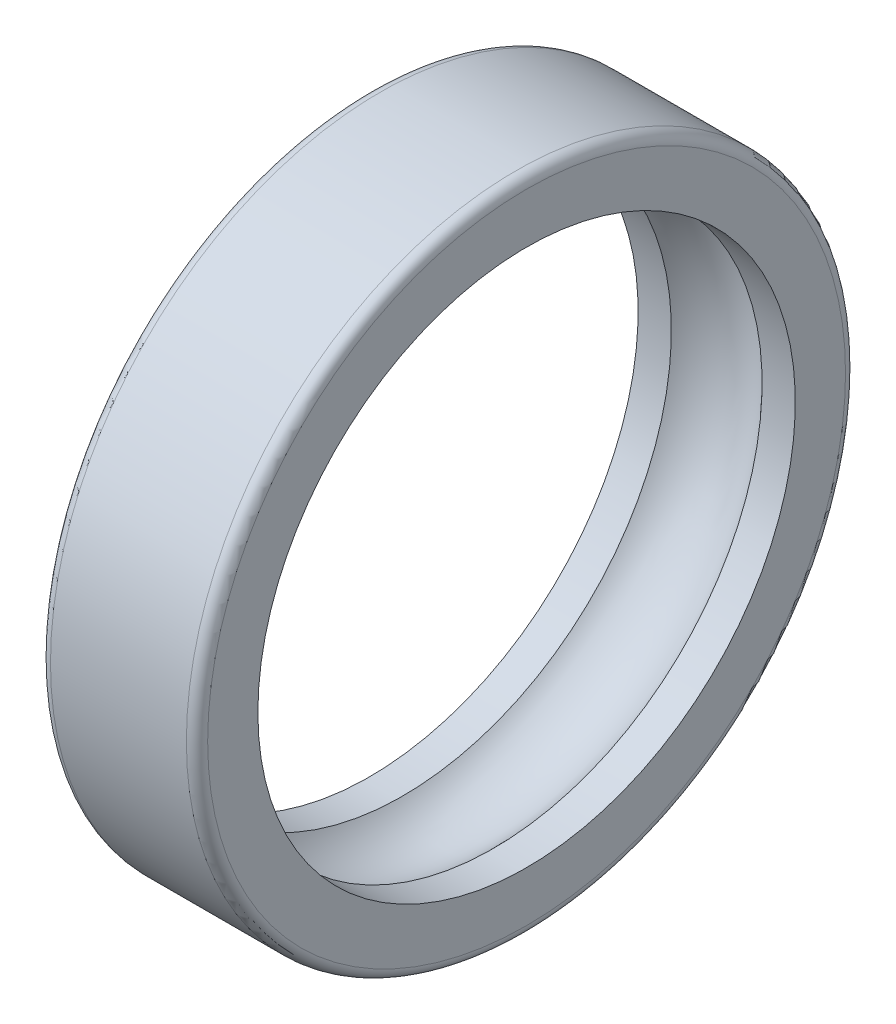
ISO-10303-21;
HEADER;
FILE_DESCRIPTION(('STEP AP214'),'2;1');
FILE_NAME('part.step','',(''),(''),'','','');
FILE_SCHEMA(('AUTOMOTIVE_DESIGN { 1 0 10303 214 1 1 1 1 }'));
ENDSEC;
DATA;
#1=APPLICATION_CONTEXT('core data for automotive mechanical design processes');
#2=APPLICATION_PROTOCOL_DEFINITION('international standard','automotive_design',2000,#1);
#3=PRODUCT_CONTEXT('',#1,'mechanical');
#4=PRODUCT('Part','Part','',(#3));
#5=PRODUCT_RELATED_PRODUCT_CATEGORY('part','',(#4));
#6=PRODUCT_DEFINITION_FORMATION('','',#4);
#7=PRODUCT_DEFINITION_CONTEXT('part definition',#1,'design');
#8=PRODUCT_DEFINITION('design','',#6,#7);
#9=PRODUCT_DEFINITION_SHAPE('','',#8);
#10=(LENGTH_UNIT() NAMED_UNIT(*) SI_UNIT(.MILLI.,.METRE.));
#11=(NAMED_UNIT(*) PLANE_ANGLE_UNIT() SI_UNIT($,.RADIAN.));
#12=(NAMED_UNIT(*) SI_UNIT($,.STERADIAN.) SOLID_ANGLE_UNIT());
#13=UNCERTAINTY_MEASURE_WITH_UNIT(LENGTH_MEASURE(1.E-05),#10,'distance_accuracy_value','');
#14=(GEOMETRIC_REPRESENTATION_CONTEXT(3) GLOBAL_UNCERTAINTY_ASSIGNED_CONTEXT((#13)) GLOBAL_UNIT_ASSIGNED_CONTEXT((#10,
#11,#12)) REPRESENTATION_CONTEXT('',''));
#15=CARTESIAN_POINT('',(0.,0.,0.));
#16=DIRECTION('',(0.,0.,1.));
#17=DIRECTION('',(1.,0.,0.));
#18=AXIS2_PLACEMENT_3D('',#15,#16,#17);
#19=CARTESIAN_POINT('',(15.5,53.,0.));
#20=DIRECTION('',(-1.,0.,0.));
#21=DIRECTION('',(0.,0.,1.));
#22=AXIS2_PLACEMENT_3D('',#19,#20,#21);
#23=PLANE('',#22);
#24=CARTESIAN_POINT('',(15.5,0.,0.));
#25=DIRECTION('',(-1.,0.,0.));
#26=DIRECTION('',(0.,0.,1.));
#27=AXIS2_PLACEMENT_3D('',#24,#25,#26);
#28=CIRCLE('',#27,62.9);
#29=CARTESIAN_POINT('',(15.5,0.,62.9));
#30=VERTEX_POINT('',#29);
#31=EDGE_CURVE('E49',#30,#30,#28,.F.);
#32=ORIENTED_EDGE('',*,*,#31,.T.);
#33=EDGE_LOOP('',(#32));
#34=FACE_BOUND('',#33,.T.);
#35=CARTESIAN_POINT('',(15.5,0.,0.));
#36=DIRECTION('',(-1.,0.,0.));
#37=DIRECTION('',(0.,0.,1.));
#38=AXIS2_PLACEMENT_3D('',#35,#36,#37);
#39=CIRCLE('',#38,53.);
#40=CARTESIAN_POINT('',(15.5,0.,53.));
#41=VERTEX_POINT('',#40);
#42=EDGE_CURVE('E65',#41,#41,#39,.T.);
#43=ORIENTED_EDGE('',*,*,#42,.T.);
#44=EDGE_LOOP('',(#43));
#45=FACE_BOUND('',#44,.T.);
#46=ADVANCED_FACE('F41',(#34,#45),#23,.F.);
#47=CARTESIAN_POINT('',(-47.7916666666667,0.,0.));
#48=DIRECTION('',(-1.,0.,0.));
#49=DIRECTION('',(0.,0.,1.));
#50=AXIS2_PLACEMENT_3D('',#47,#48,#49);
#51=CYLINDRICAL_SURFACE('',#50,53.);
#52=ORIENTED_EDGE('',*,*,#42,.F.);
#53=EDGE_LOOP('',(#52));
#54=FACE_BOUND('',#53,.T.);
#55=CARTESIAN_POINT('',(8.94427190999916,0.,0.));
#56=DIRECTION('',(-1.,0.,0.));
#57=DIRECTION('',(0.,0.,1.));
#58=AXIS2_PLACEMENT_3D('',#55,#56,#57);
#59=CIRCLE('',#58,53.);
#60=CARTESIAN_POINT('',(8.94427190999916,0.,53.));
#61=VERTEX_POINT('',#60);
#62=EDGE_CURVE('E69',#61,#61,#59,.T.);
#63=ORIENTED_EDGE('',*,*,#62,.T.);
#64=EDGE_LOOP('',(#63));
#65=FACE_BOUND('',#64,.T.);
#66=ADVANCED_FACE('F99',(#54,#65),#51,.F.);
#67=CARTESIAN_POINT('',(0.,0.,0.));
#68=DIRECTION('',(-1.,0.,0.));
#69=DIRECTION('',(0.,0.,1.));
#70=AXIS2_PLACEMENT_3D('',#67,#68,#69);
#71=TOROIDAL_SURFACE('',#70,45.,12.);
#72=ORIENTED_EDGE('',*,*,#62,.F.);
#73=EDGE_LOOP('',(#72));
#74=FACE_BOUND('',#73,.T.);
#75=CARTESIAN_POINT('',(-8.94427190999916,0.,0.));
#76=DIRECTION('',(-1.,0.,0.));
#77=DIRECTION('',(0.,0.,1.));
#78=AXIS2_PLACEMENT_3D('',#75,#76,#77);
#79=CIRCLE('',#78,53.);
#80=CARTESIAN_POINT('',(-8.94427190999916,0.,53.));
#81=VERTEX_POINT('',#80);
#82=EDGE_CURVE('E73',#81,#81,#79,.T.);
#83=ORIENTED_EDGE('',*,*,#82,.T.);
#84=EDGE_LOOP('',(#83));
#85=FACE_BOUND('',#84,.T.);
#86=ADVANCED_FACE('F95',(#74,#85),#71,.F.);
#87=CARTESIAN_POINT('',(-47.7916666666667,0.,0.));
#88=DIRECTION('',(-1.,0.,0.));
#89=DIRECTION('',(0.,0.,1.));
#90=AXIS2_PLACEMENT_3D('',#87,#88,#89);
#91=CYLINDRICAL_SURFACE('',#90,53.);
#92=ORIENTED_EDGE('',*,*,#82,.F.);
#93=EDGE_LOOP('',(#92));
#94=FACE_BOUND('',#93,.T.);
#95=CARTESIAN_POINT('',(-15.5,0.,0.));
#96=DIRECTION('',(-1.,0.,0.));
#97=DIRECTION('',(0.,0.,1.));
#98=AXIS2_PLACEMENT_3D('',#95,#96,#97);
#99=CIRCLE('',#98,53.);
#100=CARTESIAN_POINT('',(-15.5,0.,53.));
#101=VERTEX_POINT('',#100);
#102=EDGE_CURVE('E77',#101,#101,#99,.T.);
#103=ORIENTED_EDGE('',*,*,#102,.T.);
#104=EDGE_LOOP('',(#103));
#105=FACE_BOUND('',#104,.T.);
#106=ADVANCED_FACE('F82',(#94,#105),#91,.F.);
#107=CARTESIAN_POINT('',(-15.5,53.,0.));
#108=DIRECTION('',(1.,0.,0.));
#109=DIRECTION('',(0.,0.,-1.));
#110=AXIS2_PLACEMENT_3D('',#107,#108,#109);
#111=PLANE('',#110);
#112=CARTESIAN_POINT('',(-15.5,0.,0.));
#113=DIRECTION('',(1.,0.,0.));
#114=DIRECTION('',(0.,0.,-1.));
#115=AXIS2_PLACEMENT_3D('',#112,#113,#114);
#116=CIRCLE('',#115,62.9);
#117=CARTESIAN_POINT('',(-15.5,0.,-62.9));
#118=VERTEX_POINT('',#117);
#119=EDGE_CURVE('E10',#118,#118,#116,.F.);
#120=ORIENTED_EDGE('',*,*,#119,.T.);
#121=EDGE_LOOP('',(#120));
#122=FACE_BOUND('',#121,.T.);
#123=ORIENTED_EDGE('',*,*,#102,.F.);
#124=EDGE_LOOP('',(#123));
#125=FACE_BOUND('',#124,.T.);
#126=ADVANCED_FACE('F84',(#122,#125),#111,.F.);
#127=CARTESIAN_POINT('',(-47.7916666666667,0.,0.));
#128=DIRECTION('',(-1.,0.,0.));
#129=DIRECTION('',(0.,0.,1.));
#130=AXIS2_PLACEMENT_3D('',#127,#128,#129);
#131=CYLINDRICAL_SURFACE('',#130,65.);
#132=CARTESIAN_POINT('',(13.4,0.,0.));
#133=DIRECTION('',(-1.,0.,0.));
#134=DIRECTION('',(0.,0.,1.));
#135=AXIS2_PLACEMENT_3D('',#132,#133,#134);
#136=CIRCLE('',#135,65.);
#137=CARTESIAN_POINT('',(13.4,0.,65.));
#138=VERTEX_POINT('',#137);
#139=EDGE_CURVE('E54',#138,#138,#136,.T.);
#140=ORIENTED_EDGE('',*,*,#139,.T.);
#141=EDGE_LOOP('',(#140));
#142=FACE_BOUND('',#141,.T.);
#143=CARTESIAN_POINT('',(-13.4,0.,0.));
#144=DIRECTION('',(1.,0.,0.));
#145=DIRECTION('',(0.,0.,-1.));
#146=AXIS2_PLACEMENT_3D('',#143,#144,#145);
#147=CIRCLE('',#146,65.);
#148=CARTESIAN_POINT('',(-13.4,0.,-65.));
#149=VERTEX_POINT('',#148);
#150=EDGE_CURVE('E59',#149,#149,#147,.T.);
#151=ORIENTED_EDGE('',*,*,#150,.T.);
#152=EDGE_LOOP('',(#151));
#153=FACE_BOUND('',#152,.T.);
#154=ADVANCED_FACE('F86',(#142,#153),#131,.T.);
#155=CARTESIAN_POINT('',(13.4,0.,0.));
#156=DIRECTION('',(-1.,0.,0.));
#157=DIRECTION('',(0.,0.,1.));
#158=AXIS2_PLACEMENT_3D('',#155,#156,#157);
#159=TOROIDAL_SURFACE('',#158,62.9,2.1);
#160=ORIENTED_EDGE('',*,*,#31,.F.);
#161=EDGE_LOOP('',(#160));
#162=FACE_BOUND('',#161,.T.);
#163=ORIENTED_EDGE('',*,*,#139,.F.);
#164=EDGE_LOOP('',(#163));
#165=FACE_BOUND('',#164,.T.);
#166=ADVANCED_FACE('F92',(#162,#165),#159,.T.);
#167=CARTESIAN_POINT('',(-13.4,0.,0.));
#168=DIRECTION('',(1.,0.,0.));
#169=DIRECTION('',(0.,0.,-1.));
#170=AXIS2_PLACEMENT_3D('',#167,#168,#169);
#171=TOROIDAL_SURFACE('',#170,62.9,2.1);
#172=ORIENTED_EDGE('',*,*,#150,.F.);
#173=EDGE_LOOP('',(#172));
#174=FACE_BOUND('',#173,.T.);
#175=ORIENTED_EDGE('',*,*,#119,.F.);
#176=EDGE_LOOP('',(#175));
#177=FACE_BOUND('',#176,.T.);
#178=ADVANCED_FACE('F43',(#174,#177),#171,.T.);
#179=CLOSED_SHELL('',(#46,#66,#86,#106,#126,#154,#166,#178));
#180=MANIFOLD_SOLID_BREP('B2',#179);
#181=ADVANCED_BREP_SHAPE_REPRESENTATION('',(#18,#180),#14);
#182=SHAPE_DEFINITION_REPRESENTATION(#9,#181);
ENDSEC;
END-ISO-10303-21;
